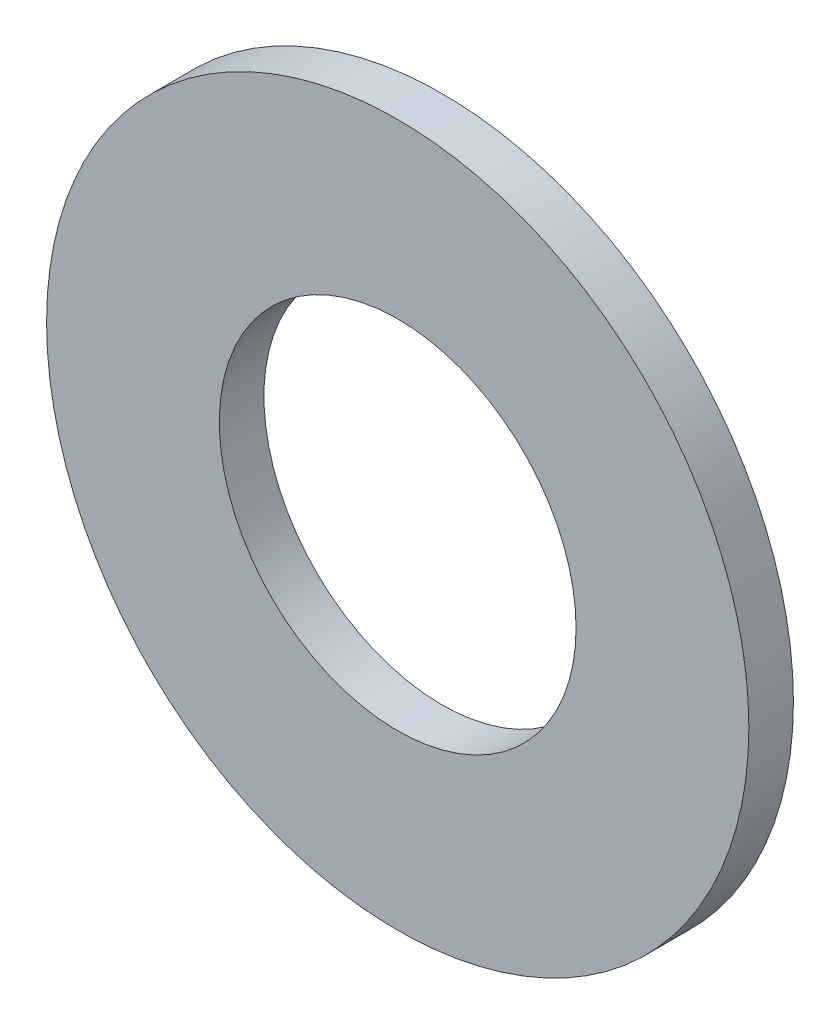
ISO-10303-21;
HEADER;
FILE_DESCRIPTION(('STEP AP214'),'2;1');
FILE_NAME('part.step','',(''),(''),'','','');
FILE_SCHEMA(('AUTOMOTIVE_DESIGN { 1 0 10303 214 1 1 1 1 }'));
ENDSEC;
DATA;
#1=APPLICATION_CONTEXT('core data for automotive mechanical design processes');
#2=APPLICATION_PROTOCOL_DEFINITION('international standard','automotive_design',2000,#1);
#3=PRODUCT_CONTEXT('',#1,'mechanical');
#4=PRODUCT('Part','Part','',(#3));
#5=PRODUCT_RELATED_PRODUCT_CATEGORY('part','',(#4));
#6=PRODUCT_DEFINITION_FORMATION('','',#4);
#7=PRODUCT_DEFINITION_CONTEXT('part definition',#1,'design');
#8=PRODUCT_DEFINITION('design','',#6,#7);
#9=PRODUCT_DEFINITION_SHAPE('','',#8);
#10=(LENGTH_UNIT() NAMED_UNIT(*) SI_UNIT(.MILLI.,.METRE.));
#11=(NAMED_UNIT(*) PLANE_ANGLE_UNIT() SI_UNIT($,.RADIAN.));
#12=(NAMED_UNIT(*) SI_UNIT($,.STERADIAN.) SOLID_ANGLE_UNIT());
#13=UNCERTAINTY_MEASURE_WITH_UNIT(LENGTH_MEASURE(1.E-05),#10,'distance_accuracy_value','');
#14=(GEOMETRIC_REPRESENTATION_CONTEXT(3) GLOBAL_UNCERTAINTY_ASSIGNED_CONTEXT((#13)) GLOBAL_UNIT_ASSIGNED_CONTEXT((#10,
#11,#12)) REPRESENTATION_CONTEXT('',''));
#15=CARTESIAN_POINT('',(0.,0.,0.));
#16=DIRECTION('',(0.,0.,1.));
#17=DIRECTION('',(1.,0.,0.));
#18=AXIS2_PLACEMENT_3D('',#15,#16,#17);
#19=CARTESIAN_POINT('',(0.,0.,0.4));
#20=DIRECTION('',(0.,0.,1.));
#21=DIRECTION('',(1.,0.,0.));
#22=AXIS2_PLACEMENT_3D('',#19,#20,#21);
#23=PLANE('',#22);
#24=CARTESIAN_POINT('',(0.,0.,0.4));
#25=DIRECTION('',(0.,0.,1.));
#26=DIRECTION('',(1.,0.,0.));
#27=AXIS2_PLACEMENT_3D('',#24,#25,#26);
#28=CIRCLE('',#27,3.15);
#29=CARTESIAN_POINT('',(3.15,0.,0.4));
#30=VERTEX_POINT('',#29);
#31=EDGE_CURVE('E10',#30,#30,#28,.T.);
#32=ORIENTED_EDGE('',*,*,#31,.T.);
#33=EDGE_LOOP('',(#32));
#34=FACE_BOUND('',#33,.T.);
#35=CARTESIAN_POINT('',(0.,0.,0.4));
#36=DIRECTION('',(0.,0.,1.));
#37=DIRECTION('',(1.,0.,0.));
#38=AXIS2_PLACEMENT_3D('',#35,#36,#37);
#39=CIRCLE('',#38,1.6);
#40=CARTESIAN_POINT('',(1.6,0.,0.4));
#41=VERTEX_POINT('',#40);
#42=EDGE_CURVE('E57',#41,#41,#39,.T.);
#43=ORIENTED_EDGE('',*,*,#42,.F.);
#44=EDGE_LOOP('',(#43));
#45=FACE_BOUND('',#44,.T.);
#46=ADVANCED_FACE('F43',(#34,#45),#23,.T.);
#47=CARTESIAN_POINT('',(0.,0.,0.));
#48=DIRECTION('',(0.,0.,1.));
#49=DIRECTION('',(1.,0.,0.));
#50=AXIS2_PLACEMENT_3D('',#47,#48,#49);
#51=PLANE('',#50);
#52=CARTESIAN_POINT('',(0.,0.,0.));
#53=DIRECTION('',(0.,0.,1.));
#54=DIRECTION('',(1.,0.,0.));
#55=AXIS2_PLACEMENT_3D('',#52,#53,#54);
#56=CIRCLE('',#55,3.15);
#57=CARTESIAN_POINT('',(3.15,0.,0.));
#58=VERTEX_POINT('',#57);
#59=EDGE_CURVE('E47',#58,#58,#56,.T.);
#60=ORIENTED_EDGE('',*,*,#59,.F.);
#61=EDGE_LOOP('',(#60));
#62=FACE_BOUND('',#61,.T.);
#63=CARTESIAN_POINT('',(0.,0.,0.));
#64=DIRECTION('',(0.,0.,1.));
#65=DIRECTION('',(1.,0.,0.));
#66=AXIS2_PLACEMENT_3D('',#63,#64,#65);
#67=CIRCLE('',#66,1.6);
#68=CARTESIAN_POINT('',(1.6,0.,0.));
#69=VERTEX_POINT('',#68);
#70=EDGE_CURVE('E59',#69,#69,#67,.T.);
#71=ORIENTED_EDGE('',*,*,#70,.T.);
#72=EDGE_LOOP('',(#71));
#73=FACE_BOUND('',#72,.T.);
#74=ADVANCED_FACE('F70',(#62,#73),#51,.F.);
#75=CARTESIAN_POINT('',(0.,0.,0.4));
#76=DIRECTION('',(0.,0.,-1.));
#77=DIRECTION('',(-1.,0.,0.));
#78=AXIS2_PLACEMENT_3D('',#75,#76,#77);
#79=CYLINDRICAL_SURFACE('',#78,3.15);
#80=ORIENTED_EDGE('',*,*,#31,.F.);
#81=EDGE_LOOP('',(#80));
#82=FACE_BOUND('',#81,.T.);
#83=ORIENTED_EDGE('',*,*,#59,.T.);
#84=EDGE_LOOP('',(#83));
#85=FACE_BOUND('',#84,.T.);
#86=ADVANCED_FACE('F45',(#82,#85),#79,.T.);
#87=CARTESIAN_POINT('',(0.,0.,0.4));
#88=DIRECTION('',(0.,0.,-1.));
#89=DIRECTION('',(-1.,0.,0.));
#90=AXIS2_PLACEMENT_3D('',#87,#88,#89);
#91=CYLINDRICAL_SURFACE('',#90,1.6);
#92=ORIENTED_EDGE('',*,*,#42,.T.);
#93=EDGE_LOOP('',(#92));
#94=FACE_BOUND('',#93,.T.);
#95=ORIENTED_EDGE('',*,*,#70,.F.);
#96=EDGE_LOOP('',(#95));
#97=FACE_BOUND('',#96,.T.);
#98=ADVANCED_FACE('F66',(#94,#97),#91,.F.);
#99=CLOSED_SHELL('',(#46,#74,#86,#98));
#100=MANIFOLD_SOLID_BREP('B2',#99);
#101=ADVANCED_BREP_SHAPE_REPRESENTATION('',(#18,#100),#14);
#102=SHAPE_DEFINITION_REPRESENTATION(#9,#101);
ENDSEC;
END-ISO-10303-21;
